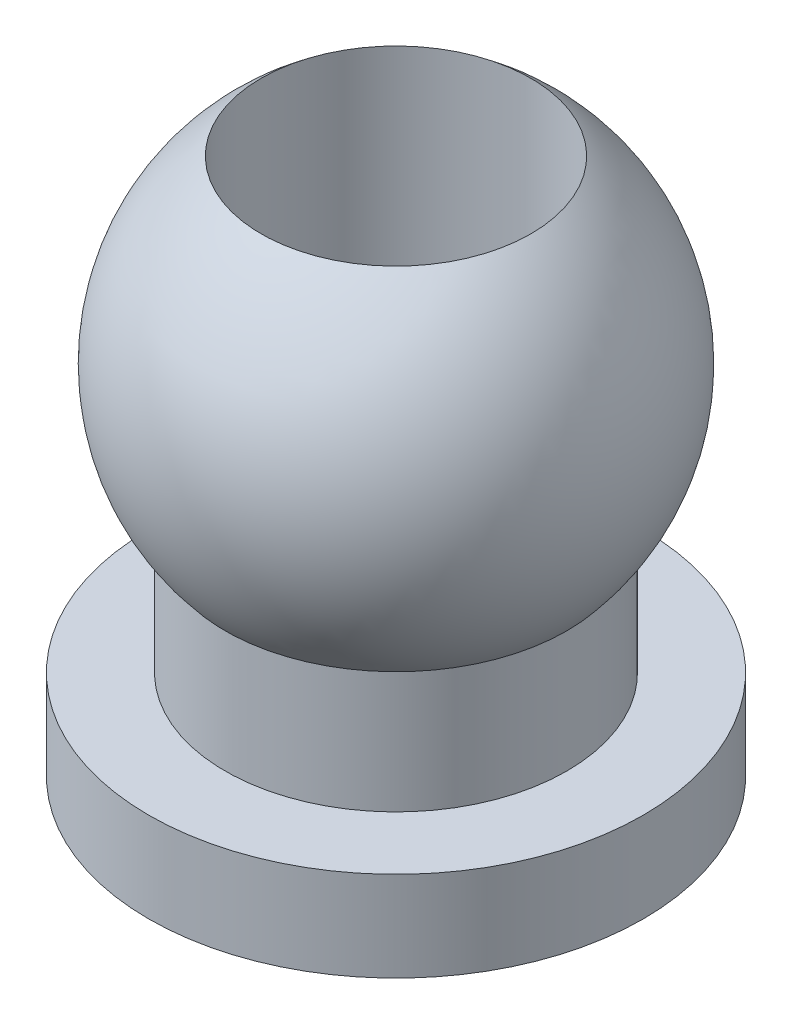
ISO-10303-21;
HEADER;
FILE_DESCRIPTION(('STEP AP214'),'2;1');
FILE_NAME('part.step','',(''),(''),'','','');
FILE_SCHEMA(('AUTOMOTIVE_DESIGN { 1 0 10303 214 1 1 1 1 }'));
ENDSEC;
DATA;
#1=APPLICATION_CONTEXT('core data for automotive mechanical design processes');
#2=APPLICATION_PROTOCOL_DEFINITION('international standard','automotive_design',2000,#1);
#3=PRODUCT_CONTEXT('',#1,'mechanical');
#4=PRODUCT('Part','Part','',(#3));
#5=PRODUCT_RELATED_PRODUCT_CATEGORY('part','',(#4));
#6=PRODUCT_DEFINITION_FORMATION('','',#4);
#7=PRODUCT_DEFINITION_CONTEXT('part definition',#1,'design');
#8=PRODUCT_DEFINITION('design','',#6,#7);
#9=PRODUCT_DEFINITION_SHAPE('','',#8);
#10=(LENGTH_UNIT() NAMED_UNIT(*) SI_UNIT(.MILLI.,.METRE.));
#11=(NAMED_UNIT(*) PLANE_ANGLE_UNIT() SI_UNIT($,.RADIAN.));
#12=(NAMED_UNIT(*) SI_UNIT($,.STERADIAN.) SOLID_ANGLE_UNIT());
#13=UNCERTAINTY_MEASURE_WITH_UNIT(LENGTH_MEASURE(1.E-05),#10,'distance_accuracy_value','');
#14=(GEOMETRIC_REPRESENTATION_CONTEXT(3) GLOBAL_UNCERTAINTY_ASSIGNED_CONTEXT((#13)) GLOBAL_UNIT_ASSIGNED_CONTEXT((#10,
#11,#12)) REPRESENTATION_CONTEXT('',''));
#15=CARTESIAN_POINT('',(0.,0.,0.));
#16=DIRECTION('',(0.,0.,1.));
#17=DIRECTION('',(1.,0.,0.));
#18=AXIS2_PLACEMENT_3D('',#15,#16,#17);
#19=CARTESIAN_POINT('',(0.,-3.97530862000051,0.));
#20=DIRECTION('',(0.,1.,0.));
#21=DIRECTION('',(-1.,0.,0.));
#22=AXIS2_PLACEMENT_3D('',#19,#20,#21);
#23=PLANE('',#22);
#24=CARTESIAN_POINT('',(0.,-3.97530862000051,0.));
#25=DIRECTION('',(0.,-1.,0.));
#26=DIRECTION('',(1.,0.,0.));
#27=AXIS2_PLACEMENT_3D('',#24,#25,#26);
#28=CIRCLE('',#27,1.5);
#29=CARTESIAN_POINT('',(1.5,-3.97530862000051,0.));
#30=VERTEX_POINT('',#29);
#31=EDGE_CURVE('E49',#30,#30,#28,.T.);
#32=ORIENTED_EDGE('',*,*,#31,.F.);
#33=EDGE_LOOP('',(#32));
#34=FACE_BOUND('',#33,.T.);
#35=CARTESIAN_POINT('',(0.,-3.97530862000051,0.));
#36=DIRECTION('',(0.,1.,0.));
#37=DIRECTION('',(-1.,0.,0.));
#38=AXIS2_PLACEMENT_3D('',#35,#36,#37);
#39=CIRCLE('',#38,2.75);
#40=CARTESIAN_POINT('',(-2.75,-3.97530862000051,0.));
#41=VERTEX_POINT('',#40);
#42=EDGE_CURVE('E10',#41,#41,#39,.T.);
#43=ORIENTED_EDGE('',*,*,#42,.F.);
#44=EDGE_LOOP('',(#43));
#45=FACE_BOUND('',#44,.T.);
#46=ADVANCED_FACE('F30',(#34,#45),#23,.F.);
#47=CARTESIAN_POINT('',(0.,2.75,0.));
#48=DIRECTION('',(0.,1.,0.));
#49=DIRECTION('',(-1.,0.,0.));
#50=AXIS2_PLACEMENT_3D('',#47,#48,#49);
#51=CYLINDRICAL_SURFACE('',#50,2.75);
#52=CARTESIAN_POINT('',(0.,-2.97530862000051,0.));
#53=DIRECTION('',(0.,1.,0.));
#54=DIRECTION('',(-1.,0.,0.));
#55=AXIS2_PLACEMENT_3D('',#52,#53,#54);
#56=CIRCLE('',#55,2.75);
#57=CARTESIAN_POINT('',(-2.75,-2.97530862000051,0.));
#58=VERTEX_POINT('',#57);
#59=EDGE_CURVE('E37',#58,#58,#56,.T.);
#60=ORIENTED_EDGE('',*,*,#59,.F.);
#61=EDGE_LOOP('',(#60));
#62=FACE_BOUND('',#61,.T.);
#63=ORIENTED_EDGE('',*,*,#42,.T.);
#64=EDGE_LOOP('',(#63));
#65=FACE_BOUND('',#64,.T.);
#66=ADVANCED_FACE('F68',(#62,#65),#51,.T.);
#67=CARTESIAN_POINT('',(2.75,-2.97530862000051,0.));
#68=DIRECTION('',(0.,-1.,0.));
#69=DIRECTION('',(1.,0.,0.));
#70=AXIS2_PLACEMENT_3D('',#67,#68,#69);
#71=PLANE('',#70);
#72=CARTESIAN_POINT('',(0.,-2.97530862000051,0.));
#73=DIRECTION('',(0.,1.,0.));
#74=DIRECTION('',(-1.,0.,0.));
#75=AXIS2_PLACEMENT_3D('',#72,#73,#74);
#76=CIRCLE('',#75,1.9);
#77=CARTESIAN_POINT('',(-1.9,-2.97530862000051,0.));
#78=VERTEX_POINT('',#77);
#79=EDGE_CURVE('E41',#78,#78,#76,.T.);
#80=ORIENTED_EDGE('',*,*,#79,.F.);
#81=EDGE_LOOP('',(#80));
#82=FACE_BOUND('',#81,.T.);
#83=ORIENTED_EDGE('',*,*,#59,.T.);
#84=EDGE_LOOP('',(#83));
#85=FACE_BOUND('',#84,.T.);
#86=ADVANCED_FACE('F73',(#82,#85),#71,.F.);
#87=CARTESIAN_POINT('',(0.,2.75,0.));
#88=DIRECTION('',(0.,1.,0.));
#89=DIRECTION('',(-1.,0.,0.));
#90=AXIS2_PLACEMENT_3D('',#87,#88,#89);
#91=CYLINDRICAL_SURFACE('',#90,1.9);
#92=CARTESIAN_POINT('',(0.,-1.62480768092719,0.));
#93=DIRECTION('',(0.,1.,0.));
#94=DIRECTION('',(-1.,0.,0.));
#95=AXIS2_PLACEMENT_3D('',#92,#93,#94);
#96=CIRCLE('',#95,1.9);
#97=CARTESIAN_POINT('',(-1.9,-1.62480768092719,0.));
#98=VERTEX_POINT('',#97);
#99=EDGE_CURVE('E46',#98,#98,#96,.T.);
#100=ORIENTED_EDGE('',*,*,#99,.F.);
#101=EDGE_LOOP('',(#100));
#102=FACE_BOUND('',#101,.T.);
#103=ORIENTED_EDGE('',*,*,#79,.T.);
#104=EDGE_LOOP('',(#103));
#105=FACE_BOUND('',#104,.T.);
#106=ADVANCED_FACE('F65',(#102,#105),#91,.T.);
#107=CARTESIAN_POINT('',(0.,0.,0.));
#108=DIRECTION('',(0.,1.,0.));
#109=DIRECTION('',(1.,0.,0.));
#110=AXIS2_PLACEMENT_3D('',#107,#108,#109);
#111=SPHERICAL_SURFACE('',#110,2.5);
#112=CARTESIAN_POINT('',(0.,2.,0.));
#113=DIRECTION('',(0.,-1.,0.));
#114=DIRECTION('',(1.,0.,0.));
#115=AXIS2_PLACEMENT_3D('',#112,#113,#114);
#116=CIRCLE('',#115,1.5);
#117=CARTESIAN_POINT('',(1.5,2.,0.));
#118=VERTEX_POINT('',#117);
#119=EDGE_CURVE('E33',#118,#118,#116,.T.);
#120=ORIENTED_EDGE('',*,*,#119,.T.);
#121=EDGE_LOOP('',(#120));
#122=FACE_BOUND('',#121,.T.);
#123=ORIENTED_EDGE('',*,*,#99,.T.);
#124=EDGE_LOOP('',(#123));
#125=FACE_BOUND('',#124,.T.);
#126=ADVANCED_FACE('F56',(#122,#125),#111,.T.);
#127=CARTESIAN_POINT('',(0.,2.02469137999949,0.));
#128=DIRECTION('',(0.,-1.,0.));
#129=DIRECTION('',(1.,0.,0.));
#130=AXIS2_PLACEMENT_3D('',#127,#128,#129);
#131=CYLINDRICAL_SURFACE('',#130,1.5);
#132=ORIENTED_EDGE('',*,*,#31,.T.);
#133=EDGE_LOOP('',(#132));
#134=FACE_BOUND('',#133,.T.);
#135=ORIENTED_EDGE('',*,*,#119,.F.);
#136=EDGE_LOOP('',(#135));
#137=FACE_BOUND('',#136,.T.);
#138=ADVANCED_FACE('F59',(#134,#137),#131,.F.);
#139=CLOSED_SHELL('',(#46,#66,#86,#106,#126,#138));
#140=MANIFOLD_SOLID_BREP('B2',#139);
#141=ADVANCED_BREP_SHAPE_REPRESENTATION('',(#18,#140),#14);
#142=SHAPE_DEFINITION_REPRESENTATION(#9,#141);
ENDSEC;
END-ISO-10303-21;
